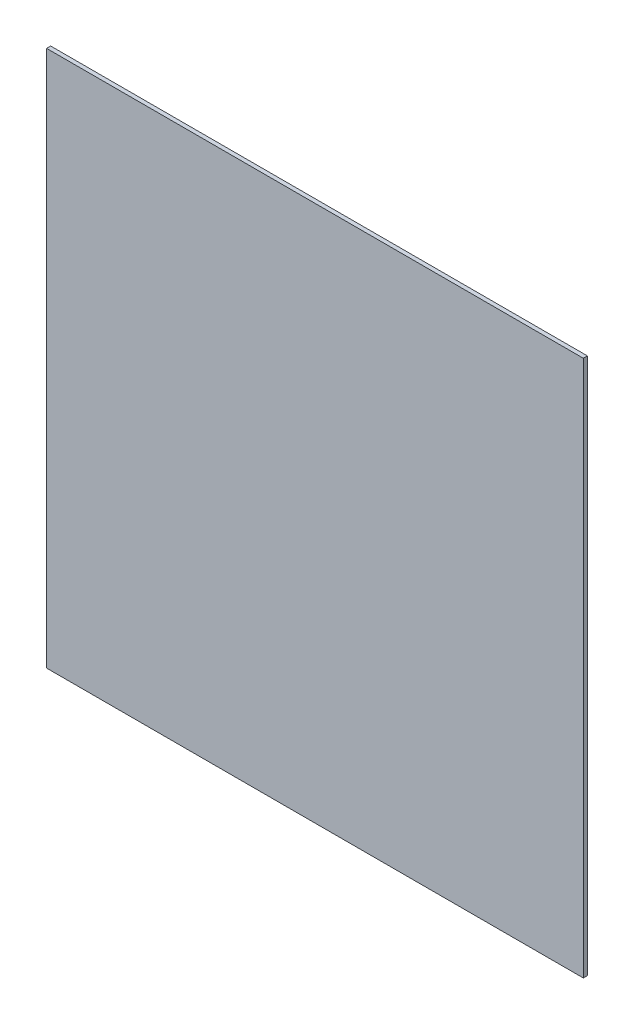
ISO-10303-21;
HEADER;
FILE_DESCRIPTION(('STEP AP214'),'2;1');
FILE_NAME('part.step','',(''),(''),'','','');
FILE_SCHEMA(('AUTOMOTIVE_DESIGN { 1 0 10303 214 1 1 1 1 }'));
ENDSEC;
DATA;
#1=APPLICATION_CONTEXT('core data for automotive mechanical design processes');
#2=APPLICATION_PROTOCOL_DEFINITION('international standard','automotive_design',2000,#1);
#3=PRODUCT_CONTEXT('',#1,'mechanical');
#4=PRODUCT('Part','Part','',(#3));
#5=PRODUCT_RELATED_PRODUCT_CATEGORY('part','',(#4));
#6=PRODUCT_DEFINITION_FORMATION('','',#4);
#7=PRODUCT_DEFINITION_CONTEXT('part definition',#1,'design');
#8=PRODUCT_DEFINITION('design','',#6,#7);
#9=PRODUCT_DEFINITION_SHAPE('','',#8);
#10=(LENGTH_UNIT() NAMED_UNIT(*) SI_UNIT(.MILLI.,.METRE.));
#11=(NAMED_UNIT(*) PLANE_ANGLE_UNIT() SI_UNIT($,.RADIAN.));
#12=(NAMED_UNIT(*) SI_UNIT($,.STERADIAN.) SOLID_ANGLE_UNIT());
#13=UNCERTAINTY_MEASURE_WITH_UNIT(LENGTH_MEASURE(1.E-05),#10,'distance_accuracy_value','');
#14=(GEOMETRIC_REPRESENTATION_CONTEXT(3) GLOBAL_UNCERTAINTY_ASSIGNED_CONTEXT((#13)) GLOBAL_UNIT_ASSIGNED_CONTEXT((#10,
#11,#12)) REPRESENTATION_CONTEXT('',''));
#15=CARTESIAN_POINT('',(0.,0.,0.));
#16=DIRECTION('',(0.,0.,1.));
#17=DIRECTION('',(1.,0.,0.));
#18=AXIS2_PLACEMENT_3D('',#15,#16,#17);
#19=CARTESIAN_POINT('',(197.,197.,0.));
#20=DIRECTION('',(0.,0.,1.));
#21=DIRECTION('',(1.,0.,0.));
#22=AXIS2_PLACEMENT_3D('',#19,#20,#21);
#23=PLANE('',#22);
#24=DIRECTION('',(0.,1.,0.));
#25=VECTOR('',#24,1.);
#26=CARTESIAN_POINT('',(0.,394.,0.));
#27=LINE('',#26,#25);
#28=CARTESIAN_POINT('',(0.,394.,0.));
#29=VERTEX_POINT('',#28);
#30=CARTESIAN_POINT('',(0.,0.,0.));
#31=VERTEX_POINT('',#30);
#32=EDGE_CURVE('E78',#29,#31,#27,.F.);
#33=ORIENTED_EDGE('',*,*,#32,.F.);
#34=DIRECTION('',(1.,0.,0.));
#35=VECTOR('',#34,1.);
#36=CARTESIAN_POINT('',(394.,394.,0.));
#37=LINE('',#36,#35);
#38=CARTESIAN_POINT('',(394.,394.,0.));
#39=VERTEX_POINT('',#38);
#40=EDGE_CURVE('E54',#39,#29,#37,.F.);
#41=ORIENTED_EDGE('',*,*,#40,.F.);
#42=DIRECTION('',(0.,1.,0.));
#43=VECTOR('',#42,1.);
#44=CARTESIAN_POINT('',(394.,0.,0.));
#45=LINE('',#44,#43);
#46=CARTESIAN_POINT('',(394.,0.,0.));
#47=VERTEX_POINT('',#46);
#48=EDGE_CURVE('E56',#47,#39,#45,.T.);
#49=ORIENTED_EDGE('',*,*,#48,.F.);
#50=DIRECTION('',(1.,0.,0.));
#51=VECTOR('',#50,1.);
#52=CARTESIAN_POINT('',(0.,0.,0.));
#53=LINE('',#52,#51);
#54=EDGE_CURVE('E19',#31,#47,#53,.T.);
#55=ORIENTED_EDGE('',*,*,#54,.F.);
#56=EDGE_LOOP('',(#33,#41,#49,#55));
#57=FACE_BOUND('',#56,.T.);
#58=ADVANCED_FACE('F16',(#57),#23,.F.);
#59=CARTESIAN_POINT('',(0.,0.,0.));
#60=DIRECTION('',(0.,-1.,0.));
#61=DIRECTION('',(0.,0.,-1.));
#62=AXIS2_PLACEMENT_3D('',#59,#60,#61);
#63=PLANE('',#62);
#64=DIRECTION('',(1.,0.,0.));
#65=VECTOR('',#64,1.);
#66=CARTESIAN_POINT('',(197.,0.,3.));
#67=LINE('',#66,#65);
#68=CARTESIAN_POINT('',(0.,0.,3.));
#69=VERTEX_POINT('',#68);
#70=CARTESIAN_POINT('',(394.,0.,3.));
#71=VERTEX_POINT('',#70);
#72=EDGE_CURVE('E82',#69,#71,#67,.T.);
#73=ORIENTED_EDGE('',*,*,#72,.F.);
#74=DIRECTION('',(0.,0.,1.));
#75=VECTOR('',#74,1.);
#76=CARTESIAN_POINT('',(0.,0.,0.));
#77=LINE('',#76,#75);
#78=EDGE_CURVE('E67',#31,#69,#77,.T.);
#79=ORIENTED_EDGE('',*,*,#78,.F.);
#80=ORIENTED_EDGE('',*,*,#54,.T.);
#81=DIRECTION('',(0.,0.,-1.));
#82=VECTOR('',#81,1.);
#83=CARTESIAN_POINT('',(394.,0.,0.));
#84=LINE('',#83,#82);
#85=EDGE_CURVE('E62',#71,#47,#84,.T.);
#86=ORIENTED_EDGE('',*,*,#85,.F.);
#87=EDGE_LOOP('',(#73,#79,#80,#86));
#88=FACE_BOUND('',#87,.T.);
#89=ADVANCED_FACE('F64',(#88),#63,.T.);
#90=CARTESIAN_POINT('',(394.,0.,0.));
#91=DIRECTION('',(1.,0.,0.));
#92=DIRECTION('',(0.,0.,-1.));
#93=AXIS2_PLACEMENT_3D('',#90,#91,#92);
#94=PLANE('',#93);
#95=DIRECTION('',(0.,1.,0.));
#96=VECTOR('',#95,1.);
#97=CARTESIAN_POINT('',(394.,197.,3.));
#98=LINE('',#97,#96);
#99=CARTESIAN_POINT('',(394.,394.,3.));
#100=VERTEX_POINT('',#99);
#101=EDGE_CURVE('E71',#71,#100,#98,.T.);
#102=ORIENTED_EDGE('',*,*,#101,.F.);
#103=ORIENTED_EDGE('',*,*,#85,.T.);
#104=ORIENTED_EDGE('',*,*,#48,.T.);
#105=DIRECTION('',(0.,0.,1.));
#106=VECTOR('',#105,1.);
#107=CARTESIAN_POINT('',(394.,394.,0.));
#108=LINE('',#107,#106);
#109=EDGE_CURVE('E74',#100,#39,#108,.F.);
#110=ORIENTED_EDGE('',*,*,#109,.F.);
#111=EDGE_LOOP('',(#102,#103,#104,#110));
#112=FACE_BOUND('',#111,.T.);
#113=ADVANCED_FACE('F69',(#112),#94,.T.);
#114=CARTESIAN_POINT('',(394.,394.,0.));
#115=DIRECTION('',(0.,1.,0.));
#116=DIRECTION('',(0.,0.,1.));
#117=AXIS2_PLACEMENT_3D('',#114,#115,#116);
#118=PLANE('',#117);
#119=DIRECTION('',(1.,0.,0.));
#120=VECTOR('',#119,1.);
#121=CARTESIAN_POINT('',(197.,394.,3.));
#122=LINE('',#121,#120);
#123=CARTESIAN_POINT('',(0.,394.,3.));
#124=VERTEX_POINT('',#123);
#125=EDGE_CURVE('E25',#100,#124,#122,.F.);
#126=ORIENTED_EDGE('',*,*,#125,.F.);
#127=ORIENTED_EDGE('',*,*,#109,.T.);
#128=ORIENTED_EDGE('',*,*,#40,.T.);
#129=DIRECTION('',(0.,0.,1.));
#130=VECTOR('',#129,1.);
#131=CARTESIAN_POINT('',(0.,394.,0.));
#132=LINE('',#131,#130);
#133=EDGE_CURVE('E34',#124,#29,#132,.F.);
#134=ORIENTED_EDGE('',*,*,#133,.F.);
#135=EDGE_LOOP('',(#126,#127,#128,#134));
#136=FACE_BOUND('',#135,.T.);
#137=ADVANCED_FACE('F88',(#136),#118,.T.);
#138=CARTESIAN_POINT('',(0.,394.,0.));
#139=DIRECTION('',(-1.,0.,0.));
#140=DIRECTION('',(0.,0.,1.));
#141=AXIS2_PLACEMENT_3D('',#138,#139,#140);
#142=PLANE('',#141);
#143=DIRECTION('',(0.,1.,0.));
#144=VECTOR('',#143,1.);
#145=CARTESIAN_POINT('',(0.,197.,3.));
#146=LINE('',#145,#144);
#147=EDGE_CURVE('E11',#124,#69,#146,.F.);
#148=ORIENTED_EDGE('',*,*,#147,.F.);
#149=ORIENTED_EDGE('',*,*,#133,.T.);
#150=ORIENTED_EDGE('',*,*,#32,.T.);
#151=ORIENTED_EDGE('',*,*,#78,.T.);
#152=EDGE_LOOP('',(#148,#149,#150,#151));
#153=FACE_BOUND('',#152,.T.);
#154=ADVANCED_FACE('F90',(#153),#142,.T.);
#155=CARTESIAN_POINT('',(197.,197.,3.));
#156=DIRECTION('',(0.,0.,1.));
#157=DIRECTION('',(1.,0.,0.));
#158=AXIS2_PLACEMENT_3D('',#155,#156,#157);
#159=PLANE('',#158);
#160=ORIENTED_EDGE('',*,*,#125,.T.);
#161=ORIENTED_EDGE('',*,*,#147,.T.);
#162=ORIENTED_EDGE('',*,*,#72,.T.);
#163=ORIENTED_EDGE('',*,*,#101,.T.);
#164=EDGE_LOOP('',(#160,#161,#162,#163));
#165=FACE_BOUND('',#164,.T.);
#166=ADVANCED_FACE('F87',(#165),#159,.T.);
#167=CLOSED_SHELL('',(#58,#89,#113,#137,#154,#166));
#168=MANIFOLD_SOLID_BREP('B1',#167);
#169=ADVANCED_BREP_SHAPE_REPRESENTATION('',(#18,#168),#14);
#170=SHAPE_DEFINITION_REPRESENTATION(#9,#169);
ENDSEC;
END-ISO-10303-21;
